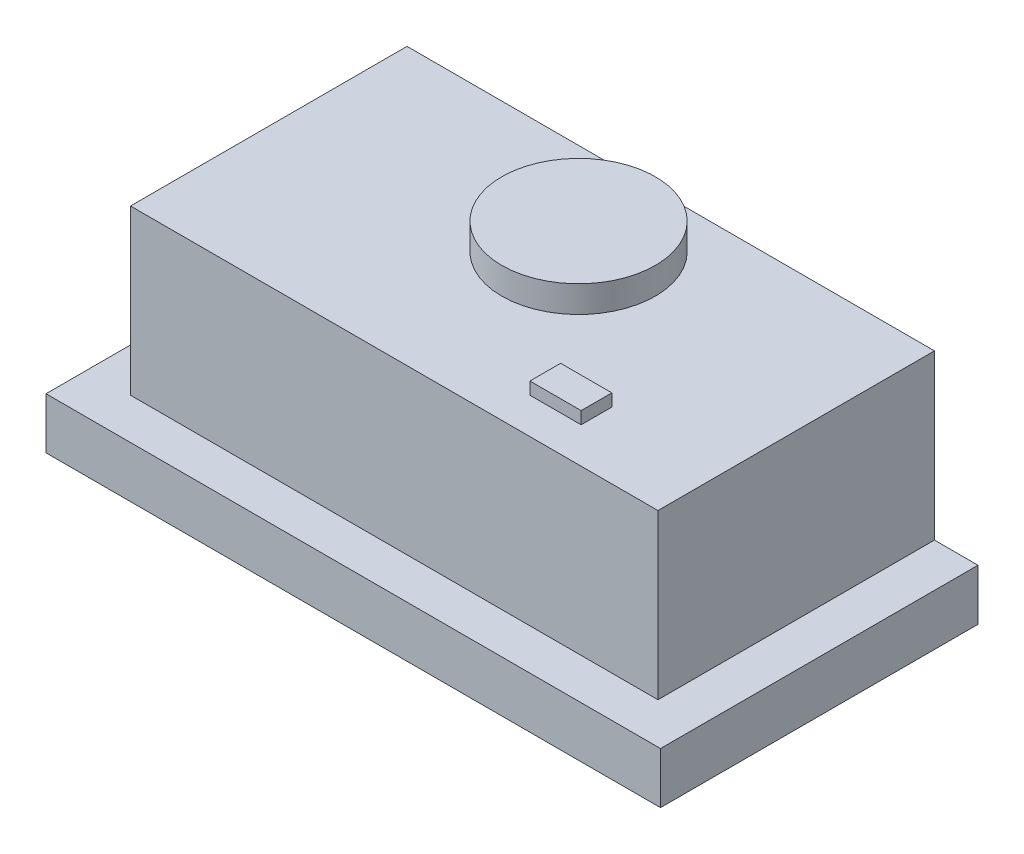
ISO-10303-21;
HEADER;
FILE_DESCRIPTION(('STEP AP214'),'2;1');
FILE_NAME('part.step','',(''),(''),'','','');
FILE_SCHEMA(('AUTOMOTIVE_DESIGN { 1 0 10303 214 1 1 1 1 }'));
ENDSEC;
DATA;
#1=APPLICATION_CONTEXT('core data for automotive mechanical design processes');
#2=APPLICATION_PROTOCOL_DEFINITION('international standard','automotive_design',2000,#1);
#3=PRODUCT_CONTEXT('',#1,'mechanical');
#4=PRODUCT('Part','Part','',(#3));
#5=PRODUCT_RELATED_PRODUCT_CATEGORY('part','',(#4));
#6=PRODUCT_DEFINITION_FORMATION('','',#4);
#7=PRODUCT_DEFINITION_CONTEXT('part definition',#1,'design');
#8=PRODUCT_DEFINITION('design','',#6,#7);
#9=PRODUCT_DEFINITION_SHAPE('','',#8);
#10=(LENGTH_UNIT() NAMED_UNIT(*) SI_UNIT(.MILLI.,.METRE.));
#11=(NAMED_UNIT(*) PLANE_ANGLE_UNIT() SI_UNIT($,.RADIAN.));
#12=(NAMED_UNIT(*) SI_UNIT($,.STERADIAN.) SOLID_ANGLE_UNIT());
#13=UNCERTAINTY_MEASURE_WITH_UNIT(LENGTH_MEASURE(1.E-05),#10,'distance_accuracy_value','');
#14=(GEOMETRIC_REPRESENTATION_CONTEXT(3) GLOBAL_UNCERTAINTY_ASSIGNED_CONTEXT((#13)) GLOBAL_UNIT_ASSIGNED_CONTEXT((#10,
#11,#12)) REPRESENTATION_CONTEXT('',''));
#15=CARTESIAN_POINT('',(0.,0.,0.));
#16=DIRECTION('',(0.,0.,1.));
#17=DIRECTION('',(1.,0.,0.));
#18=AXIS2_PLACEMENT_3D('',#15,#16,#17);
#19=CARTESIAN_POINT('',(0.,210.,0.));
#20=DIRECTION('',(0.,1.,0.));
#21=DIRECTION('',(0.,0.,1.));
#22=AXIS2_PLACEMENT_3D('',#19,#20,#21);
#23=PLANE('',#22);
#24=DIRECTION('',(0.,0.,-1.));
#25=VECTOR('',#24,1.);
#26=CARTESIAN_POINT('',(97.5,210.,79.9999999999999));
#27=LINE('',#26,#25);
#28=CARTESIAN_POINT('',(97.5,210.,79.9999999999999));
#29=VERTEX_POINT('',#28);
#30=CARTESIAN_POINT('',(97.5,210.,49.9999999999999));
#31=VERTEX_POINT('',#30);
#32=EDGE_CURVE('E128',#29,#31,#27,.T.);
#33=ORIENTED_EDGE('',*,*,#32,.T.);
#34=DIRECTION('',(1.,0.,0.));
#35=VECTOR('',#34,1.);
#36=CARTESIAN_POINT('',(97.5,210.,49.9999999999999));
#37=LINE('',#36,#35);
#38=CARTESIAN_POINT('',(147.5,210.,49.9999999999999));
#39=VERTEX_POINT('',#38);
#40=EDGE_CURVE('E149',#31,#39,#37,.T.);
#41=ORIENTED_EDGE('',*,*,#40,.T.);
#42=DIRECTION('',(0.,0.,-1.));
#43=VECTOR('',#42,1.);
#44=CARTESIAN_POINT('',(147.5,210.,79.9999999999999));
#45=LINE('',#44,#43);
#46=CARTESIAN_POINT('',(147.5,210.,79.9999999999999));
#47=VERTEX_POINT('',#46);
#48=EDGE_CURVE('E148',#47,#39,#45,.T.);
#49=ORIENTED_EDGE('',*,*,#48,.F.);
#50=DIRECTION('',(1.,0.,0.));
#51=VECTOR('',#50,1.);
#52=CARTESIAN_POINT('',(97.5,210.,79.9999999999999));
#53=LINE('',#52,#51);
#54=EDGE_CURVE('E142',#29,#47,#53,.T.);
#55=ORIENTED_EDGE('',*,*,#54,.F.);
#56=EDGE_LOOP('',(#33,#41,#49,#55));
#57=FACE_BOUND('',#56,.T.);
#58=DIRECTION('',(0.,0.,1.));
#59=VECTOR('',#58,1.);
#60=CARTESIAN_POINT('',(-257.5,210.,115.));
#61=LINE('',#60,#59);
#62=CARTESIAN_POINT('',(-257.5,210.,-155.));
#63=VERTEX_POINT('',#62);
#64=CARTESIAN_POINT('',(-257.5,210.,115.));
#65=VERTEX_POINT('',#64);
#66=EDGE_CURVE('E164',#63,#65,#61,.T.);
#67=ORIENTED_EDGE('',*,*,#66,.T.);
#68=DIRECTION('',(1.,0.,0.));
#69=VECTOR('',#68,1.);
#70=CARTESIAN_POINT('',(257.5,210.,115.));
#71=LINE('',#70,#69);
#72=CARTESIAN_POINT('',(257.5,210.,115.));
#73=VERTEX_POINT('',#72);
#74=EDGE_CURVE('E167',#65,#73,#71,.T.);
#75=ORIENTED_EDGE('',*,*,#74,.T.);
#76=DIRECTION('',(0.,0.,-1.));
#77=VECTOR('',#76,1.);
#78=CARTESIAN_POINT('',(257.5,210.,115.));
#79=LINE('',#78,#77);
#80=CARTESIAN_POINT('',(257.5,210.,-155.));
#81=VERTEX_POINT('',#80);
#82=EDGE_CURVE('E170',#73,#81,#79,.T.);
#83=ORIENTED_EDGE('',*,*,#82,.T.);
#84=DIRECTION('',(-1.,0.,0.));
#85=VECTOR('',#84,1.);
#86=CARTESIAN_POINT('',(257.5,210.,-155.));
#87=LINE('',#86,#85);
#88=EDGE_CURVE('E172',#81,#63,#87,.T.);
#89=ORIENTED_EDGE('',*,*,#88,.T.);
#90=EDGE_LOOP('',(#67,#75,#83,#89));
#91=FACE_BOUND('',#90,.T.);
#92=CARTESIAN_POINT('',(0.,210.,-65.0000000000001));
#93=DIRECTION('',(0.,1.,0.));
#94=DIRECTION('',(0.,0.,1.));
#95=AXIS2_PLACEMENT_3D('',#92,#93,#94);
#96=CIRCLE('',#95,75.);
#97=CARTESIAN_POINT('',(0.,210.,9.99999999999991));
#98=VERTEX_POINT('',#97);
#99=EDGE_CURVE('E161',#98,#98,#96,.T.);
#100=ORIENTED_EDGE('',*,*,#99,.F.);
#101=EDGE_LOOP('',(#100));
#102=FACE_BOUND('',#101,.T.);
#103=ADVANCED_FACE('F34',(#57,#91,#102),#23,.T.);
#104=CARTESIAN_POINT('',(-300.,50.,155.));
#105=DIRECTION('',(1.,0.,0.));
#106=DIRECTION('',(0.,0.,-1.));
#107=AXIS2_PLACEMENT_3D('',#104,#105,#106);
#108=PLANE('',#107);
#109=DIRECTION('',(0.,0.,1.));
#110=VECTOR('',#109,1.);
#111=CARTESIAN_POINT('',(-300.,0.,155.));
#112=LINE('',#111,#110);
#113=CARTESIAN_POINT('',(-300.,0.,-155.));
#114=VERTEX_POINT('',#113);
#115=CARTESIAN_POINT('',(-300.,0.,155.));
#116=VERTEX_POINT('',#115);
#117=EDGE_CURVE('E211',#114,#116,#112,.T.);
#118=ORIENTED_EDGE('',*,*,#117,.T.);
#119=DIRECTION('',(0.,-1.,0.));
#120=VECTOR('',#119,1.);
#121=CARTESIAN_POINT('',(-300.,50.,155.));
#122=LINE('',#121,#120);
#123=CARTESIAN_POINT('',(-300.,50.,155.));
#124=VERTEX_POINT('',#123);
#125=EDGE_CURVE('E11',#124,#116,#122,.T.);
#126=ORIENTED_EDGE('',*,*,#125,.F.);
#127=DIRECTION('',(0.,0.,1.));
#128=VECTOR('',#127,1.);
#129=CARTESIAN_POINT('',(-300.,50.,155.));
#130=LINE('',#129,#128);
#131=CARTESIAN_POINT('',(-300.,50.,-155.));
#132=VERTEX_POINT('',#131);
#133=EDGE_CURVE('E221',#132,#124,#130,.T.);
#134=ORIENTED_EDGE('',*,*,#133,.F.);
#135=DIRECTION('',(0.,-1.,0.));
#136=VECTOR('',#135,1.);
#137=CARTESIAN_POINT('',(-300.,50.,-155.));
#138=LINE('',#137,#136);
#139=EDGE_CURVE('E222',#132,#114,#138,.T.);
#140=ORIENTED_EDGE('',*,*,#139,.T.);
#141=EDGE_LOOP('',(#118,#126,#134,#140));
#142=FACE_BOUND('',#141,.T.);
#143=ADVANCED_FACE('F36',(#142),#108,.F.);
#144=CARTESIAN_POINT('',(300.,50.,155.));
#145=DIRECTION('',(0.,0.,-1.));
#146=DIRECTION('',(-1.,0.,0.));
#147=AXIS2_PLACEMENT_3D('',#144,#145,#146);
#148=PLANE('',#147);
#149=DIRECTION('',(1.,0.,0.));
#150=VECTOR('',#149,1.);
#151=CARTESIAN_POINT('',(300.,0.,155.));
#152=LINE('',#151,#150);
#153=CARTESIAN_POINT('',(300.,0.,155.));
#154=VERTEX_POINT('',#153);
#155=EDGE_CURVE('E215',#116,#154,#152,.T.);
#156=ORIENTED_EDGE('',*,*,#155,.T.);
#157=DIRECTION('',(0.,-1.,0.));
#158=VECTOR('',#157,1.);
#159=CARTESIAN_POINT('',(300.,50.,155.));
#160=LINE('',#159,#158);
#161=CARTESIAN_POINT('',(300.,50.,155.));
#162=VERTEX_POINT('',#161);
#163=EDGE_CURVE('E43',#162,#154,#160,.T.);
#164=ORIENTED_EDGE('',*,*,#163,.F.);
#165=DIRECTION('',(1.,0.,0.));
#166=VECTOR('',#165,1.);
#167=CARTESIAN_POINT('',(300.,50.,155.));
#168=LINE('',#167,#166);
#169=EDGE_CURVE('E247',#124,#162,#168,.T.);
#170=ORIENTED_EDGE('',*,*,#169,.F.);
#171=ORIENTED_EDGE('',*,*,#125,.T.);
#172=EDGE_LOOP('',(#156,#164,#170,#171));
#173=FACE_BOUND('',#172,.T.);
#174=ADVANCED_FACE('F259',(#173),#148,.F.);
#175=CARTESIAN_POINT('',(300.,50.,155.));
#176=DIRECTION('',(-1.,0.,0.));
#177=DIRECTION('',(0.,0.,1.));
#178=AXIS2_PLACEMENT_3D('',#175,#176,#177);
#179=PLANE('',#178);
#180=DIRECTION('',(0.,0.,-1.));
#181=VECTOR('',#180,1.);
#182=CARTESIAN_POINT('',(300.,0.,155.));
#183=LINE('',#182,#181);
#184=CARTESIAN_POINT('',(300.,0.,-155.));
#185=VERTEX_POINT('',#184);
#186=EDGE_CURVE('E217',#154,#185,#183,.T.);
#187=ORIENTED_EDGE('',*,*,#186,.T.);
#188=DIRECTION('',(0.,-1.,0.));
#189=VECTOR('',#188,1.);
#190=CARTESIAN_POINT('',(300.,50.,-155.));
#191=LINE('',#190,#189);
#192=CARTESIAN_POINT('',(300.,50.,-155.));
#193=VERTEX_POINT('',#192);
#194=EDGE_CURVE('E225',#193,#185,#191,.T.);
#195=ORIENTED_EDGE('',*,*,#194,.F.);
#196=DIRECTION('',(0.,0.,-1.));
#197=VECTOR('',#196,1.);
#198=CARTESIAN_POINT('',(300.,50.,155.));
#199=LINE('',#198,#197);
#200=EDGE_CURVE('E206',#162,#193,#199,.T.);
#201=ORIENTED_EDGE('',*,*,#200,.F.);
#202=ORIENTED_EDGE('',*,*,#163,.T.);
#203=EDGE_LOOP('',(#187,#195,#201,#202));
#204=FACE_BOUND('',#203,.T.);
#205=ADVANCED_FACE('F233',(#204),#179,.F.);
#206=CARTESIAN_POINT('',(300.,50.,-155.));
#207=DIRECTION('',(0.,0.,1.));
#208=DIRECTION('',(1.,0.,0.));
#209=AXIS2_PLACEMENT_3D('',#206,#207,#208);
#210=PLANE('',#209);
#211=DIRECTION('',(-1.,0.,0.));
#212=VECTOR('',#211,1.);
#213=CARTESIAN_POINT('',(300.,0.,-155.));
#214=LINE('',#213,#212);
#215=EDGE_CURVE('E219',#185,#114,#214,.T.);
#216=ORIENTED_EDGE('',*,*,#215,.T.);
#217=ORIENTED_EDGE('',*,*,#139,.F.);
#218=DIRECTION('',(-1.,0.,0.));
#219=VECTOR('',#218,1.);
#220=CARTESIAN_POINT('',(300.,50.,-155.));
#221=LINE('',#220,#219);
#222=CARTESIAN_POINT('',(-257.5,50.,-155.));
#223=VERTEX_POINT('',#222);
#224=EDGE_CURVE('E202',#223,#132,#221,.T.);
#225=ORIENTED_EDGE('',*,*,#224,.F.);
#226=DIRECTION('',(0.,-1.,0.));
#227=VECTOR('',#226,1.);
#228=CARTESIAN_POINT('',(-257.5,210.,-155.));
#229=LINE('',#228,#227);
#230=EDGE_CURVE('E174',#63,#223,#229,.T.);
#231=ORIENTED_EDGE('',*,*,#230,.F.);
#232=ORIENTED_EDGE('',*,*,#88,.F.);
#233=DIRECTION('',(0.,-1.,0.));
#234=VECTOR('',#233,1.);
#235=CARTESIAN_POINT('',(257.5,210.,-155.));
#236=LINE('',#235,#234);
#237=CARTESIAN_POINT('',(257.5,50.,-155.));
#238=VERTEX_POINT('',#237);
#239=EDGE_CURVE('E185',#81,#238,#236,.T.);
#240=ORIENTED_EDGE('',*,*,#239,.T.);
#241=EDGE_CURVE('E205',#193,#238,#221,.T.);
#242=ORIENTED_EDGE('',*,*,#241,.F.);
#243=ORIENTED_EDGE('',*,*,#194,.T.);
#244=EDGE_LOOP('',(#216,#217,#225,#231,#232,#240,#242,#243));
#245=FACE_BOUND('',#244,.T.);
#246=ADVANCED_FACE('F241',(#245),#210,.F.);
#247=CARTESIAN_POINT('',(0.,50.,0.));
#248=DIRECTION('',(0.,1.,0.));
#249=DIRECTION('',(0.,0.,1.));
#250=AXIS2_PLACEMENT_3D('',#247,#248,#249);
#251=PLANE('',#250);
#252=DIRECTION('',(0.,0.,1.));
#253=VECTOR('',#252,1.);
#254=CARTESIAN_POINT('',(-257.5,50.,115.));
#255=LINE('',#254,#253);
#256=CARTESIAN_POINT('',(-257.5,50.,115.));
#257=VERTEX_POINT('',#256);
#258=EDGE_CURVE('E160',#223,#257,#255,.T.);
#259=ORIENTED_EDGE('',*,*,#258,.F.);
#260=ORIENTED_EDGE('',*,*,#224,.T.);
#261=ORIENTED_EDGE('',*,*,#133,.T.);
#262=ORIENTED_EDGE('',*,*,#169,.T.);
#263=ORIENTED_EDGE('',*,*,#200,.T.);
#264=ORIENTED_EDGE('',*,*,#241,.T.);
#265=DIRECTION('',(0.,0.,-1.));
#266=VECTOR('',#265,1.);
#267=CARTESIAN_POINT('',(257.5,50.,115.));
#268=LINE('',#267,#266);
#269=CARTESIAN_POINT('',(257.5,50.,115.));
#270=VERTEX_POINT('',#269);
#271=EDGE_CURVE('E168',#270,#238,#268,.T.);
#272=ORIENTED_EDGE('',*,*,#271,.F.);
#273=DIRECTION('',(1.,0.,0.));
#274=VECTOR('',#273,1.);
#275=CARTESIAN_POINT('',(257.5,50.,115.));
#276=LINE('',#275,#274);
#277=EDGE_CURVE('E59',#257,#270,#276,.T.);
#278=ORIENTED_EDGE('',*,*,#277,.F.);
#279=EDGE_LOOP('',(#259,#260,#261,#262,#263,#264,#272,#278));
#280=FACE_BOUND('',#279,.T.);
#281=ADVANCED_FACE('F254',(#280),#251,.T.);
#282=CARTESIAN_POINT('',(0.,0.,0.));
#283=DIRECTION('',(0.,1.,0.));
#284=DIRECTION('',(0.,0.,1.));
#285=AXIS2_PLACEMENT_3D('',#282,#283,#284);
#286=PLANE('',#285);
#287=ORIENTED_EDGE('',*,*,#117,.F.);
#288=ORIENTED_EDGE('',*,*,#215,.F.);
#289=ORIENTED_EDGE('',*,*,#186,.F.);
#290=ORIENTED_EDGE('',*,*,#155,.F.);
#291=EDGE_LOOP('',(#287,#288,#289,#290));
#292=FACE_BOUND('',#291,.T.);
#293=ADVANCED_FACE('F239',(#292),#286,.F.);
#294=CARTESIAN_POINT('',(-257.5,210.,115.));
#295=DIRECTION('',(1.,0.,0.));
#296=DIRECTION('',(0.,0.,-1.));
#297=AXIS2_PLACEMENT_3D('',#294,#295,#296);
#298=PLANE('',#297);
#299=ORIENTED_EDGE('',*,*,#258,.T.);
#300=DIRECTION('',(0.,-1.,0.));
#301=VECTOR('',#300,1.);
#302=CARTESIAN_POINT('',(-257.5,210.,115.));
#303=LINE('',#302,#301);
#304=EDGE_CURVE('E192',#65,#257,#303,.T.);
#305=ORIENTED_EDGE('',*,*,#304,.F.);
#306=ORIENTED_EDGE('',*,*,#66,.F.);
#307=ORIENTED_EDGE('',*,*,#230,.T.);
#308=EDGE_LOOP('',(#299,#305,#306,#307));
#309=FACE_BOUND('',#308,.T.);
#310=ADVANCED_FACE('F253',(#309),#298,.F.);
#311=CARTESIAN_POINT('',(257.5,210.,115.));
#312=DIRECTION('',(0.,0.,-1.));
#313=DIRECTION('',(-1.,0.,0.));
#314=AXIS2_PLACEMENT_3D('',#311,#312,#313);
#315=PLANE('',#314);
#316=ORIENTED_EDGE('',*,*,#277,.T.);
#317=DIRECTION('',(0.,-1.,0.));
#318=VECTOR('',#317,1.);
#319=CARTESIAN_POINT('',(257.5,210.,115.));
#320=LINE('',#319,#318);
#321=EDGE_CURVE('E178',#73,#270,#320,.T.);
#322=ORIENTED_EDGE('',*,*,#321,.F.);
#323=ORIENTED_EDGE('',*,*,#74,.F.);
#324=ORIENTED_EDGE('',*,*,#304,.T.);
#325=EDGE_LOOP('',(#316,#322,#323,#324));
#326=FACE_BOUND('',#325,.T.);
#327=ADVANCED_FACE('F251',(#326),#315,.F.);
#328=CARTESIAN_POINT('',(257.5,210.,115.));
#329=DIRECTION('',(-1.,0.,0.));
#330=DIRECTION('',(0.,0.,1.));
#331=AXIS2_PLACEMENT_3D('',#328,#329,#330);
#332=PLANE('',#331);
#333=ORIENTED_EDGE('',*,*,#271,.T.);
#334=ORIENTED_EDGE('',*,*,#239,.F.);
#335=ORIENTED_EDGE('',*,*,#82,.F.);
#336=ORIENTED_EDGE('',*,*,#321,.T.);
#337=EDGE_LOOP('',(#333,#334,#335,#336));
#338=FACE_BOUND('',#337,.T.);
#339=ADVANCED_FACE('F258',(#338),#332,.F.);
#340=CARTESIAN_POINT('',(0.,236.,-65.0000000000001));
#341=DIRECTION('',(0.,-1.,0.));
#342=DIRECTION('',(0.,0.,-1.));
#343=AXIS2_PLACEMENT_3D('',#340,#341,#342);
#344=CYLINDRICAL_SURFACE('',#343,75.);
#345=CARTESIAN_POINT('',(0.,236.,-65.0000000000001));
#346=DIRECTION('',(0.,1.,0.));
#347=DIRECTION('',(0.,0.,1.));
#348=AXIS2_PLACEMENT_3D('',#345,#346,#347);
#349=CIRCLE('',#348,75.);
#350=CARTESIAN_POINT('',(0.,236.,9.99999999999991));
#351=VERTEX_POINT('',#350);
#352=EDGE_CURVE('E157',#351,#351,#349,.T.);
#353=ORIENTED_EDGE('',*,*,#352,.F.);
#354=EDGE_LOOP('',(#353));
#355=FACE_BOUND('',#354,.T.);
#356=ORIENTED_EDGE('',*,*,#99,.T.);
#357=EDGE_LOOP('',(#356));
#358=FACE_BOUND('',#357,.T.);
#359=ADVANCED_FACE('F272',(#355,#358),#344,.T.);
#360=CARTESIAN_POINT('',(0.,236.,-65.0000000000001));
#361=DIRECTION('',(0.,1.,0.));
#362=DIRECTION('',(0.,0.,1.));
#363=AXIS2_PLACEMENT_3D('',#360,#361,#362);
#364=PLANE('',#363);
#365=ORIENTED_EDGE('',*,*,#352,.T.);
#366=EDGE_LOOP('',(#365));
#367=FACE_BOUND('',#366,.T.);
#368=ADVANCED_FACE('F315',(#367),#364,.T.);
#369=CARTESIAN_POINT('',(97.5,210.,79.9999999999999));
#370=DIRECTION('',(0.,0.,1.));
#371=DIRECTION('',(1.,0.,0.));
#372=AXIS2_PLACEMENT_3D('',#369,#370,#371);
#373=PLANE('',#372);
#374=DIRECTION('',(0.,-1.,0.));
#375=VECTOR('',#374,1.);
#376=CARTESIAN_POINT('',(147.5,210.,79.9999999999999));
#377=LINE('',#376,#375);
#378=CARTESIAN_POINT('',(147.5,222.,79.9999999999999));
#379=VERTEX_POINT('',#378);
#380=EDGE_CURVE('E51',#379,#47,#377,.T.);
#381=ORIENTED_EDGE('',*,*,#380,.F.);
#382=DIRECTION('',(1.,0.,0.));
#383=VECTOR('',#382,1.);
#384=CARTESIAN_POINT('',(97.5,222.,79.9999999999999));
#385=LINE('',#384,#383);
#386=CARTESIAN_POINT('',(97.5,222.,79.9999999999999));
#387=VERTEX_POINT('',#386);
#388=EDGE_CURVE('E144',#387,#379,#385,.T.);
#389=ORIENTED_EDGE('',*,*,#388,.F.);
#390=DIRECTION('',(0.,-1.,0.));
#391=VECTOR('',#390,1.);
#392=CARTESIAN_POINT('',(97.5,210.,79.9999999999999));
#393=LINE('',#392,#391);
#394=EDGE_CURVE('E132',#387,#29,#393,.T.);
#395=ORIENTED_EDGE('',*,*,#394,.T.);
#396=ORIENTED_EDGE('',*,*,#54,.T.);
#397=EDGE_LOOP('',(#381,#389,#395,#396));
#398=FACE_BOUND('',#397,.T.);
#399=ADVANCED_FACE('F141',(#398),#373,.T.);
#400=CARTESIAN_POINT('',(97.5,222.,79.9999999999999));
#401=DIRECTION('',(0.,1.,0.));
#402=DIRECTION('',(0.,0.,1.));
#403=AXIS2_PLACEMENT_3D('',#400,#401,#402);
#404=PLANE('',#403);
#405=DIRECTION('',(0.,0.,1.));
#406=VECTOR('',#405,1.);
#407=CARTESIAN_POINT('',(147.5,222.,79.9999999999999));
#408=LINE('',#407,#406);
#409=CARTESIAN_POINT('',(147.5,222.,49.9999999999999));
#410=VERTEX_POINT('',#409);
#411=EDGE_CURVE('E145',#410,#379,#408,.T.);
#412=ORIENTED_EDGE('',*,*,#411,.F.);
#413=DIRECTION('',(1.,0.,0.));
#414=VECTOR('',#413,1.);
#415=CARTESIAN_POINT('',(97.5,222.,49.9999999999999));
#416=LINE('',#415,#414);
#417=CARTESIAN_POINT('',(97.5,222.,49.9999999999999));
#418=VERTEX_POINT('',#417);
#419=EDGE_CURVE('E152',#418,#410,#416,.T.);
#420=ORIENTED_EDGE('',*,*,#419,.F.);
#421=DIRECTION('',(0.,0.,1.));
#422=VECTOR('',#421,1.);
#423=CARTESIAN_POINT('',(97.5,222.,79.9999999999999));
#424=LINE('',#423,#422);
#425=EDGE_CURVE('E150',#418,#387,#424,.T.);
#426=ORIENTED_EDGE('',*,*,#425,.T.);
#427=ORIENTED_EDGE('',*,*,#388,.T.);
#428=EDGE_LOOP('',(#412,#420,#426,#427));
#429=FACE_BOUND('',#428,.T.);
#430=ADVANCED_FACE('F328',(#429),#404,.T.);
#431=CARTESIAN_POINT('',(97.5,210.,49.9999999999999));
#432=DIRECTION('',(0.,0.,-1.));
#433=DIRECTION('',(-1.,0.,0.));
#434=AXIS2_PLACEMENT_3D('',#431,#432,#433);
#435=PLANE('',#434);
#436=DIRECTION('',(0.,1.,0.));
#437=VECTOR('',#436,1.);
#438=CARTESIAN_POINT('',(147.5,210.,49.9999999999999));
#439=LINE('',#438,#437);
#440=EDGE_CURVE('E409',#39,#410,#439,.T.);
#441=ORIENTED_EDGE('',*,*,#440,.F.);
#442=ORIENTED_EDGE('',*,*,#40,.F.);
#443=DIRECTION('',(0.,1.,0.));
#444=VECTOR('',#443,1.);
#445=CARTESIAN_POINT('',(97.5,210.,49.9999999999999));
#446=LINE('',#445,#444);
#447=EDGE_CURVE('E135',#31,#418,#446,.T.);
#448=ORIENTED_EDGE('',*,*,#447,.T.);
#449=ORIENTED_EDGE('',*,*,#419,.T.);
#450=EDGE_LOOP('',(#441,#442,#448,#449));
#451=FACE_BOUND('',#450,.T.);
#452=ADVANCED_FACE('F335',(#451),#435,.T.);
#453=CARTESIAN_POINT('',(97.5,0.,0.));
#454=DIRECTION('',(-1.,0.,0.));
#455=DIRECTION('',(0.,0.,1.));
#456=AXIS2_PLACEMENT_3D('',#453,#454,#455);
#457=PLANE('',#456);
#458=ORIENTED_EDGE('',*,*,#394,.F.);
#459=ORIENTED_EDGE('',*,*,#425,.F.);
#460=ORIENTED_EDGE('',*,*,#447,.F.);
#461=ORIENTED_EDGE('',*,*,#32,.F.);
#462=EDGE_LOOP('',(#458,#459,#460,#461));
#463=FACE_BOUND('',#462,.T.);
#464=ADVANCED_FACE('F130',(#463),#457,.T.);
#465=CARTESIAN_POINT('',(147.5,0.,0.));
#466=DIRECTION('',(-1.,0.,0.));
#467=DIRECTION('',(0.,0.,1.));
#468=AXIS2_PLACEMENT_3D('',#465,#466,#467);
#469=PLANE('',#468);
#470=ORIENTED_EDGE('',*,*,#380,.T.);
#471=ORIENTED_EDGE('',*,*,#48,.T.);
#472=ORIENTED_EDGE('',*,*,#440,.T.);
#473=ORIENTED_EDGE('',*,*,#411,.T.);
#474=EDGE_LOOP('',(#470,#471,#472,#473));
#475=FACE_BOUND('',#474,.T.);
#476=ADVANCED_FACE('F350',(#475),#469,.F.);
#477=CLOSED_SHELL('',(#103,#143,#174,#205,#246,#281,#293,#310,#327,#339,#359,#368,#399,#430,
#452,#464,#476));
#478=MANIFOLD_SOLID_BREP('B2',#477);
#479=ADVANCED_BREP_SHAPE_REPRESENTATION('',(#18,#478),#14);
#480=SHAPE_DEFINITION_REPRESENTATION(#9,#479);
ENDSEC;
END-ISO-10303-21;
